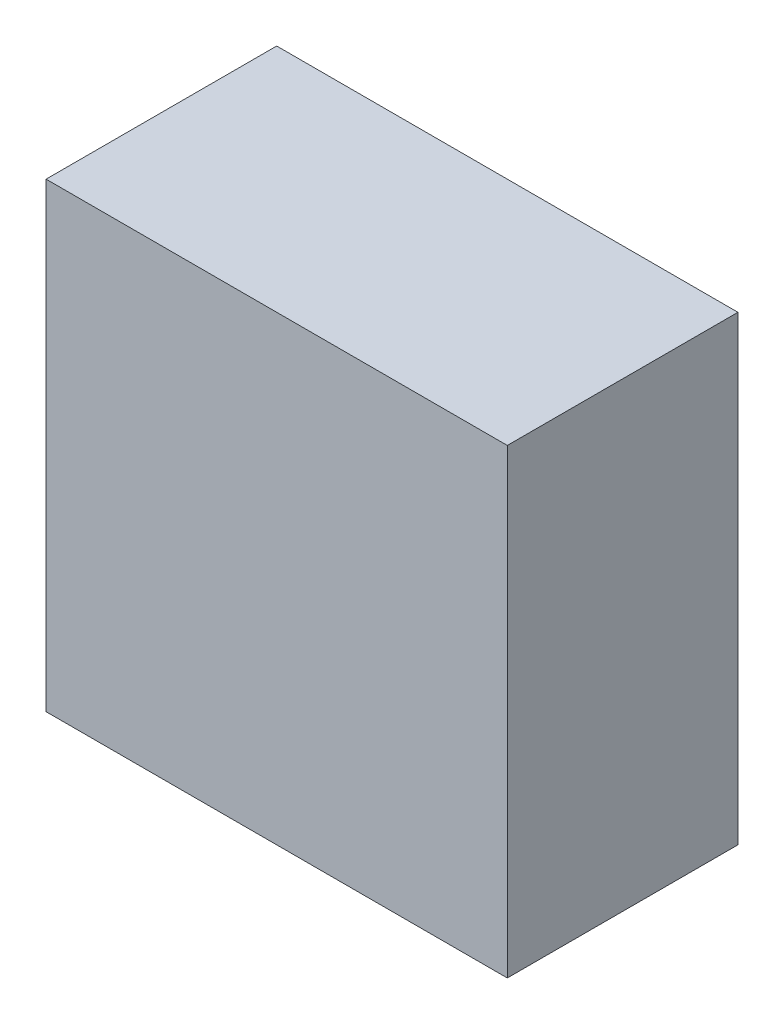
ISO-10303-21;
HEADER;
FILE_DESCRIPTION(('STEP AP214'),'2;1');
FILE_NAME('part.step','',(''),(''),'','','');
FILE_SCHEMA(('AUTOMOTIVE_DESIGN { 1 0 10303 214 1 1 1 1 }'));
ENDSEC;
DATA;
#1=APPLICATION_CONTEXT('core data for automotive mechanical design processes');
#2=APPLICATION_PROTOCOL_DEFINITION('international standard','automotive_design',2000,#1);
#3=PRODUCT_CONTEXT('',#1,'mechanical');
#4=PRODUCT('Part','Part','',(#3));
#5=PRODUCT_RELATED_PRODUCT_CATEGORY('part','',(#4));
#6=PRODUCT_DEFINITION_FORMATION('','',#4);
#7=PRODUCT_DEFINITION_CONTEXT('part definition',#1,'design');
#8=PRODUCT_DEFINITION('design','',#6,#7);
#9=PRODUCT_DEFINITION_SHAPE('','',#8);
#10=(LENGTH_UNIT() NAMED_UNIT(*) SI_UNIT(.MILLI.,.METRE.));
#11=(NAMED_UNIT(*) PLANE_ANGLE_UNIT() SI_UNIT($,.RADIAN.));
#12=(NAMED_UNIT(*) SI_UNIT($,.STERADIAN.) SOLID_ANGLE_UNIT());
#13=UNCERTAINTY_MEASURE_WITH_UNIT(LENGTH_MEASURE(1.E-05),#10,'distance_accuracy_value','');
#14=(GEOMETRIC_REPRESENTATION_CONTEXT(3) GLOBAL_UNCERTAINTY_ASSIGNED_CONTEXT((#13)) GLOBAL_UNIT_ASSIGNED_CONTEXT((#10,
#11,#12)) REPRESENTATION_CONTEXT('',''));
#15=CARTESIAN_POINT('',(0.,0.,0.));
#16=DIRECTION('',(0.,0.,1.));
#17=DIRECTION('',(1.,0.,0.));
#18=AXIS2_PLACEMENT_3D('',#15,#16,#17);
#19=CARTESIAN_POINT('',(0.,0.,2.75));
#20=DIRECTION('',(0.,0.,-1.));
#21=DIRECTION('',(-1.,0.,0.));
#22=AXIS2_PLACEMENT_3D('',#19,#20,#21);
#23=PLANE('',#22);
#24=DIRECTION('',(1.,0.,0.));
#25=VECTOR('',#24,1.);
#26=CARTESIAN_POINT('',(158.313158045851,-127.070884155696,2.75));
#27=LINE('',#26,#25);
#28=CARTESIAN_POINT('',(158.313158045851,-127.070884155696,2.75));
#29=VERTEX_POINT('',#28);
#30=CARTESIAN_POINT('',(154.313158045851,-127.070884155696,2.75));
#31=VERTEX_POINT('',#30);
#32=EDGE_CURVE('E80',#29,#31,#27,.F.);
#33=ORIENTED_EDGE('',*,*,#32,.T.);
#34=DIRECTION('',(0.,1.,0.));
#35=VECTOR('',#34,1.);
#36=CARTESIAN_POINT('',(154.313158045851,-127.070884155696,2.75));
#37=LINE('',#36,#35);
#38=CARTESIAN_POINT('',(154.313158045851,-131.070884155696,2.75));
#39=VERTEX_POINT('',#38);
#40=EDGE_CURVE('E55',#31,#39,#37,.F.);
#41=ORIENTED_EDGE('',*,*,#40,.T.);
#42=DIRECTION('',(1.,0.,0.));
#43=VECTOR('',#42,1.);
#44=CARTESIAN_POINT('',(158.313158045851,-131.070884155696,2.75));
#45=LINE('',#44,#43);
#46=CARTESIAN_POINT('',(158.313158045851,-131.070884155696,2.75));
#47=VERTEX_POINT('',#46);
#48=EDGE_CURVE('E57',#39,#47,#45,.T.);
#49=ORIENTED_EDGE('',*,*,#48,.T.);
#50=DIRECTION('',(0.,1.,0.));
#51=VECTOR('',#50,1.);
#52=CARTESIAN_POINT('',(158.313158045851,-127.070884155696,2.75));
#53=LINE('',#52,#51);
#54=EDGE_CURVE('E20',#47,#29,#53,.T.);
#55=ORIENTED_EDGE('',*,*,#54,.T.);
#56=EDGE_LOOP('',(#33,#41,#49,#55));
#57=FACE_BOUND('',#56,.T.);
#58=ADVANCED_FACE('F17',(#57),#23,.F.);
#59=CARTESIAN_POINT('',(158.313158045851,-127.070884155696,2.75));
#60=DIRECTION('',(-1.,0.,0.));
#61=DIRECTION('',(0.,0.,1.));
#62=AXIS2_PLACEMENT_3D('',#59,#60,#61);
#63=PLANE('',#62);
#64=DIRECTION('',(0.,0.,-1.));
#65=VECTOR('',#64,1.);
#66=CARTESIAN_POINT('',(158.313158045851,-127.070884155696,2.75));
#67=LINE('',#66,#65);
#68=CARTESIAN_POINT('',(158.313158045851,-127.070884155696,0.75));
#69=VERTEX_POINT('',#68);
#70=EDGE_CURVE('E68',#69,#29,#67,.F.);
#71=ORIENTED_EDGE('',*,*,#70,.T.);
#72=ORIENTED_EDGE('',*,*,#54,.F.);
#73=DIRECTION('',(0.,0.,1.));
#74=VECTOR('',#73,1.);
#75=CARTESIAN_POINT('',(158.313158045851,-131.070884155696,2.75));
#76=LINE('',#75,#74);
#77=CARTESIAN_POINT('',(158.313158045851,-131.070884155696,0.75));
#78=VERTEX_POINT('',#77);
#79=EDGE_CURVE('E63',#47,#78,#76,.F.);
#80=ORIENTED_EDGE('',*,*,#79,.T.);
#81=DIRECTION('',(0.,1.,0.));
#82=VECTOR('',#81,1.);
#83=CARTESIAN_POINT('',(158.313158045851,0.,0.75));
#84=LINE('',#83,#82);
#85=EDGE_CURVE('E83',#69,#78,#84,.F.);
#86=ORIENTED_EDGE('',*,*,#85,.F.);
#87=EDGE_LOOP('',(#71,#72,#80,#86));
#88=FACE_BOUND('',#87,.T.);
#89=ADVANCED_FACE('F65',(#88),#63,.F.);
#90=CARTESIAN_POINT('',(158.313158045851,-131.070884155696,2.75));
#91=DIRECTION('',(0.,1.,0.));
#92=DIRECTION('',(0.,0.,1.));
#93=AXIS2_PLACEMENT_3D('',#90,#91,#92);
#94=PLANE('',#93);
#95=ORIENTED_EDGE('',*,*,#79,.F.);
#96=ORIENTED_EDGE('',*,*,#48,.F.);
#97=DIRECTION('',(0.,0.,-1.));
#98=VECTOR('',#97,1.);
#99=CARTESIAN_POINT('',(154.313158045851,-131.070884155696,2.75));
#100=LINE('',#99,#98);
#101=CARTESIAN_POINT('',(154.313158045851,-131.070884155696,0.75));
#102=VERTEX_POINT('',#101);
#103=EDGE_CURVE('E75',#39,#102,#100,.T.);
#104=ORIENTED_EDGE('',*,*,#103,.T.);
#105=DIRECTION('',(-1.,0.,0.));
#106=VECTOR('',#105,1.);
#107=CARTESIAN_POINT('',(0.,-131.070884155696,0.75));
#108=LINE('',#107,#106);
#109=EDGE_CURVE('E72',#78,#102,#108,.T.);
#110=ORIENTED_EDGE('',*,*,#109,.F.);
#111=EDGE_LOOP('',(#95,#96,#104,#110));
#112=FACE_BOUND('',#111,.T.);
#113=ADVANCED_FACE('F70',(#112),#94,.F.);
#114=CARTESIAN_POINT('',(154.313158045851,-127.070884155696,2.75));
#115=DIRECTION('',(1.,0.,0.));
#116=DIRECTION('',(0.,0.,-1.));
#117=AXIS2_PLACEMENT_3D('',#114,#115,#116);
#118=PLANE('',#117);
#119=ORIENTED_EDGE('',*,*,#103,.F.);
#120=ORIENTED_EDGE('',*,*,#40,.F.);
#121=DIRECTION('',(0.,0.,-1.));
#122=VECTOR('',#121,1.);
#123=CARTESIAN_POINT('',(154.313158045851,-127.070884155696,2.75));
#124=LINE('',#123,#122);
#125=CARTESIAN_POINT('',(154.313158045851,-127.070884155696,0.75));
#126=VERTEX_POINT('',#125);
#127=EDGE_CURVE('E35',#31,#126,#124,.T.);
#128=ORIENTED_EDGE('',*,*,#127,.T.);
#129=DIRECTION('',(0.,1.,0.));
#130=VECTOR('',#129,1.);
#131=CARTESIAN_POINT('',(154.313158045851,0.,0.75));
#132=LINE('',#131,#130);
#133=EDGE_CURVE('E26',#102,#126,#132,.T.);
#134=ORIENTED_EDGE('',*,*,#133,.F.);
#135=EDGE_LOOP('',(#119,#120,#128,#134));
#136=FACE_BOUND('',#135,.T.);
#137=ADVANCED_FACE('F89',(#136),#118,.F.);
#138=CARTESIAN_POINT('',(158.313158045851,-127.070884155696,2.75));
#139=DIRECTION('',(0.,-1.,0.));
#140=DIRECTION('',(0.,0.,-1.));
#141=AXIS2_PLACEMENT_3D('',#138,#139,#140);
#142=PLANE('',#141);
#143=ORIENTED_EDGE('',*,*,#127,.F.);
#144=ORIENTED_EDGE('',*,*,#32,.F.);
#145=ORIENTED_EDGE('',*,*,#70,.F.);
#146=DIRECTION('',(-1.,0.,0.));
#147=VECTOR('',#146,1.);
#148=CARTESIAN_POINT('',(0.,-127.070884155696,0.75));
#149=LINE('',#148,#147);
#150=EDGE_CURVE('E11',#126,#69,#149,.F.);
#151=ORIENTED_EDGE('',*,*,#150,.F.);
#152=EDGE_LOOP('',(#143,#144,#145,#151));
#153=FACE_BOUND('',#152,.T.);
#154=ADVANCED_FACE('F91',(#153),#142,.F.);
#155=CARTESIAN_POINT('',(0.,0.,0.75));
#156=DIRECTION('',(0.,0.,-1.));
#157=DIRECTION('',(-1.,0.,0.));
#158=AXIS2_PLACEMENT_3D('',#155,#156,#157);
#159=PLANE('',#158);
#160=ORIENTED_EDGE('',*,*,#133,.T.);
#161=ORIENTED_EDGE('',*,*,#150,.T.);
#162=ORIENTED_EDGE('',*,*,#85,.T.);
#163=ORIENTED_EDGE('',*,*,#109,.T.);
#164=EDGE_LOOP('',(#160,#161,#162,#163));
#165=FACE_BOUND('',#164,.T.);
#166=ADVANCED_FACE('F88',(#165),#159,.T.);
#167=CLOSED_SHELL('',(#58,#89,#113,#137,#154,#166));
#168=MANIFOLD_SOLID_BREP('B1',#167);
#169=ADVANCED_BREP_SHAPE_REPRESENTATION('',(#18,#168),#14);
#170=SHAPE_DEFINITION_REPRESENTATION(#9,#169);
ENDSEC;
END-ISO-10303-21;
